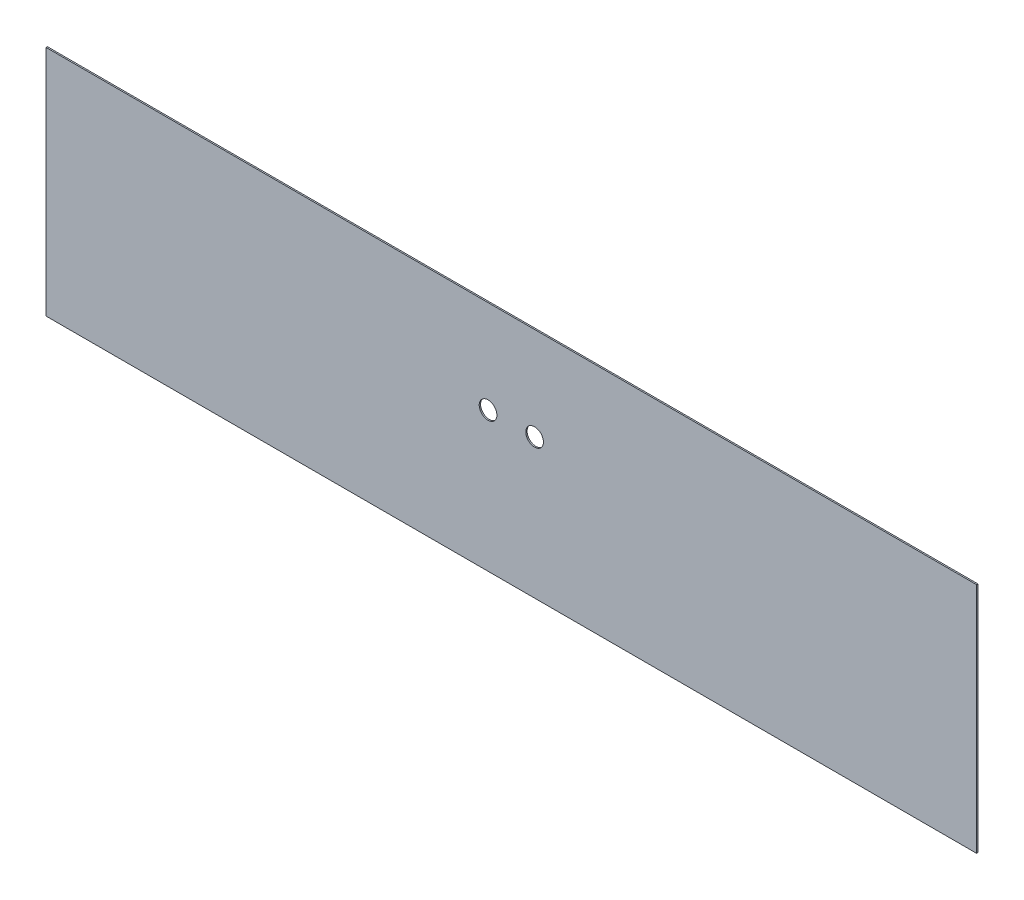
ISO-10303-21;
HEADER;
FILE_DESCRIPTION(('STEP AP214'),'2;1');
FILE_NAME('part.step','',(''),(''),'','','');
FILE_SCHEMA(('AUTOMOTIVE_DESIGN { 1 0 10303 214 1 1 1 1 }'));
ENDSEC;
DATA;
#1=APPLICATION_CONTEXT('core data for automotive mechanical design processes');
#2=APPLICATION_PROTOCOL_DEFINITION('international standard','automotive_design',2000,#1);
#3=PRODUCT_CONTEXT('',#1,'mechanical');
#4=PRODUCT('Part','Part','',(#3));
#5=PRODUCT_RELATED_PRODUCT_CATEGORY('part','',(#4));
#6=PRODUCT_DEFINITION_FORMATION('','',#4);
#7=PRODUCT_DEFINITION_CONTEXT('part definition',#1,'design');
#8=PRODUCT_DEFINITION('design','',#6,#7);
#9=PRODUCT_DEFINITION_SHAPE('','',#8);
#10=(LENGTH_UNIT() NAMED_UNIT(*) SI_UNIT(.MILLI.,.METRE.));
#11=(NAMED_UNIT(*) PLANE_ANGLE_UNIT() SI_UNIT($,.RADIAN.));
#12=(NAMED_UNIT(*) SI_UNIT($,.STERADIAN.) SOLID_ANGLE_UNIT());
#13=UNCERTAINTY_MEASURE_WITH_UNIT(LENGTH_MEASURE(1.E-05),#10,'distance_accuracy_value','');
#14=(GEOMETRIC_REPRESENTATION_CONTEXT(3) GLOBAL_UNCERTAINTY_ASSIGNED_CONTEXT((#13)) GLOBAL_UNIT_ASSIGNED_CONTEXT((#10,
#11,#12)) REPRESENTATION_CONTEXT('',''));
#15=CARTESIAN_POINT('',(0.,0.,0.));
#16=DIRECTION('',(0.,0.,1.));
#17=DIRECTION('',(1.,0.,0.));
#18=AXIS2_PLACEMENT_3D('',#15,#16,#17);
#19=CARTESIAN_POINT('',(0.,0.,-0.7366));
#20=DIRECTION('',(-1.,0.,0.));
#21=DIRECTION('',(0.,0.,1.));
#22=AXIS2_PLACEMENT_3D('',#19,#20,#21);
#23=PLANE('',#22);
#24=DIRECTION('',(0.,-1.,0.));
#25=VECTOR('',#24,1.);
#26=CARTESIAN_POINT('',(0.,0.,0.));
#27=LINE('',#26,#25);
#28=CARTESIAN_POINT('',(0.,127.,0.));
#29=VERTEX_POINT('',#28);
#30=CARTESIAN_POINT('',(0.,0.,0.));
#31=VERTEX_POINT('',#30);
#32=EDGE_CURVE('E99',#29,#31,#27,.T.);
#33=ORIENTED_EDGE('',*,*,#32,.F.);
#34=DIRECTION('',(0.,0.,1.));
#35=VECTOR('',#34,1.);
#36=CARTESIAN_POINT('',(0.,127.,-0.7366));
#37=LINE('',#36,#35);
#38=CARTESIAN_POINT('',(0.,127.,-0.7366));
#39=VERTEX_POINT('',#38);
#40=EDGE_CURVE('E11',#39,#29,#37,.T.);
#41=ORIENTED_EDGE('',*,*,#40,.F.);
#42=DIRECTION('',(0.,-1.,0.));
#43=VECTOR('',#42,1.);
#44=CARTESIAN_POINT('',(0.,0.,-0.7366));
#45=LINE('',#44,#43);
#46=CARTESIAN_POINT('',(0.,0.,-0.7366));
#47=VERTEX_POINT('',#46);
#48=EDGE_CURVE('E92',#39,#47,#45,.T.);
#49=ORIENTED_EDGE('',*,*,#48,.T.);
#50=DIRECTION('',(0.,0.,1.));
#51=VECTOR('',#50,1.);
#52=CARTESIAN_POINT('',(0.,0.,-0.7366));
#53=LINE('',#52,#51);
#54=EDGE_CURVE('E37',#47,#31,#53,.T.);
#55=ORIENTED_EDGE('',*,*,#54,.T.);
#56=EDGE_LOOP('',(#33,#41,#49,#55));
#57=FACE_BOUND('',#56,.T.);
#58=ADVANCED_FACE('F34',(#57),#23,.T.);
#59=CARTESIAN_POINT('',(0.,127.,-0.7366));
#60=DIRECTION('',(0.,1.,0.));
#61=DIRECTION('',(0.,0.,1.));
#62=AXIS2_PLACEMENT_3D('',#59,#60,#61);
#63=PLANE('',#62);
#64=DIRECTION('',(-1.,0.,0.));
#65=VECTOR('',#64,1.);
#66=CARTESIAN_POINT('',(0.,127.,0.));
#67=LINE('',#66,#65);
#68=CARTESIAN_POINT('',(508.,127.,0.));
#69=VERTEX_POINT('',#68);
#70=EDGE_CURVE('E94',#69,#29,#67,.T.);
#71=ORIENTED_EDGE('',*,*,#70,.F.);
#72=DIRECTION('',(0.,0.,1.));
#73=VECTOR('',#72,1.);
#74=CARTESIAN_POINT('',(508.,127.,-0.7366));
#75=LINE('',#74,#73);
#76=CARTESIAN_POINT('',(508.,127.,-0.7366));
#77=VERTEX_POINT('',#76);
#78=EDGE_CURVE('E43',#77,#69,#75,.T.);
#79=ORIENTED_EDGE('',*,*,#78,.F.);
#80=DIRECTION('',(-1.,0.,0.));
#81=VECTOR('',#80,1.);
#82=CARTESIAN_POINT('',(0.,127.,-0.7366));
#83=LINE('',#82,#81);
#84=EDGE_CURVE('E89',#77,#39,#83,.T.);
#85=ORIENTED_EDGE('',*,*,#84,.T.);
#86=ORIENTED_EDGE('',*,*,#40,.T.);
#87=EDGE_LOOP('',(#71,#79,#85,#86));
#88=FACE_BOUND('',#87,.T.);
#89=ADVANCED_FACE('F110',(#88),#63,.T.);
#90=CARTESIAN_POINT('',(508.,0.,-0.7366));
#91=DIRECTION('',(1.,0.,0.));
#92=DIRECTION('',(0.,0.,-1.));
#93=AXIS2_PLACEMENT_3D('',#90,#91,#92);
#94=PLANE('',#93);
#95=DIRECTION('',(0.,1.,0.));
#96=VECTOR('',#95,1.);
#97=CARTESIAN_POINT('',(508.,0.,0.));
#98=LINE('',#97,#96);
#99=CARTESIAN_POINT('',(508.,0.,0.));
#100=VERTEX_POINT('',#99);
#101=EDGE_CURVE('E84',#100,#69,#98,.T.);
#102=ORIENTED_EDGE('',*,*,#101,.F.);
#103=DIRECTION('',(0.,0.,1.));
#104=VECTOR('',#103,1.);
#105=CARTESIAN_POINT('',(508.,0.,-0.7366));
#106=LINE('',#105,#104);
#107=CARTESIAN_POINT('',(508.,0.,-0.7366));
#108=VERTEX_POINT('',#107);
#109=EDGE_CURVE('E79',#108,#100,#106,.T.);
#110=ORIENTED_EDGE('',*,*,#109,.F.);
#111=DIRECTION('',(0.,1.,0.));
#112=VECTOR('',#111,1.);
#113=CARTESIAN_POINT('',(508.,0.,-0.7366));
#114=LINE('',#113,#112);
#115=EDGE_CURVE('E82',#108,#77,#114,.T.);
#116=ORIENTED_EDGE('',*,*,#115,.T.);
#117=ORIENTED_EDGE('',*,*,#78,.T.);
#118=EDGE_LOOP('',(#102,#110,#116,#117));
#119=FACE_BOUND('',#118,.T.);
#120=ADVANCED_FACE('F81',(#119),#94,.T.);
#121=CARTESIAN_POINT('',(0.,0.,-0.7366));
#122=DIRECTION('',(0.,-1.,0.));
#123=DIRECTION('',(0.,0.,-1.));
#124=AXIS2_PLACEMENT_3D('',#121,#122,#123);
#125=PLANE('',#124);
#126=DIRECTION('',(1.,0.,0.));
#127=VECTOR('',#126,1.);
#128=CARTESIAN_POINT('',(0.,0.,0.));
#129=LINE('',#128,#127);
#130=EDGE_CURVE('E102',#31,#100,#129,.T.);
#131=ORIENTED_EDGE('',*,*,#130,.F.);
#132=ORIENTED_EDGE('',*,*,#54,.F.);
#133=DIRECTION('',(1.,0.,0.));
#134=VECTOR('',#133,1.);
#135=CARTESIAN_POINT('',(0.,0.,-0.7366));
#136=LINE('',#135,#134);
#137=EDGE_CURVE('E88',#47,#108,#136,.T.);
#138=ORIENTED_EDGE('',*,*,#137,.T.);
#139=ORIENTED_EDGE('',*,*,#109,.T.);
#140=EDGE_LOOP('',(#131,#132,#138,#139));
#141=FACE_BOUND('',#140,.T.);
#142=ADVANCED_FACE('F91',(#141),#125,.T.);
#143=CARTESIAN_POINT('',(0.,0.,-0.7366));
#144=DIRECTION('',(0.,0.,-1.));
#145=DIRECTION('',(-1.,0.,0.));
#146=AXIS2_PLACEMENT_3D('',#143,#144,#145);
#147=PLANE('',#146);
#148=CARTESIAN_POINT('',(266.7,76.2,-0.7366));
#149=DIRECTION('',(0.,0.,-1.));
#150=DIRECTION('',(-1.,0.,0.));
#151=AXIS2_PLACEMENT_3D('',#148,#149,#150);
#152=CIRCLE('',#151,4.82599999999999);
#153=CARTESIAN_POINT('',(261.874,76.2,-0.7366));
#154=VERTEX_POINT('',#153);
#155=EDGE_CURVE('E143',#154,#154,#152,.T.);
#156=ORIENTED_EDGE('',*,*,#155,.F.);
#157=EDGE_LOOP('',(#156));
#158=FACE_BOUND('',#157,.T.);
#159=CARTESIAN_POINT('',(241.3,76.2,-0.7366));
#160=DIRECTION('',(0.,0.,-1.));
#161=DIRECTION('',(-1.,0.,0.));
#162=AXIS2_PLACEMENT_3D('',#159,#160,#161);
#163=CIRCLE('',#162,4.82599999999999);
#164=CARTESIAN_POINT('',(236.474,76.2,-0.7366));
#165=VERTEX_POINT('',#164);
#166=EDGE_CURVE('E103',#165,#165,#163,.T.);
#167=ORIENTED_EDGE('',*,*,#166,.F.);
#168=EDGE_LOOP('',(#167));
#169=FACE_BOUND('',#168,.T.);
#170=ORIENTED_EDGE('',*,*,#48,.F.);
#171=ORIENTED_EDGE('',*,*,#84,.F.);
#172=ORIENTED_EDGE('',*,*,#115,.F.);
#173=ORIENTED_EDGE('',*,*,#137,.F.);
#174=EDGE_LOOP('',(#170,#171,#172,#173));
#175=FACE_BOUND('',#174,.T.);
#176=ADVANCED_FACE('F87',(#158,#169,#175),#147,.T.);
#177=CARTESIAN_POINT('',(0.,0.,0.));
#178=DIRECTION('',(0.,0.,-1.));
#179=DIRECTION('',(-1.,0.,0.));
#180=AXIS2_PLACEMENT_3D('',#177,#178,#179);
#181=PLANE('',#180);
#182=CARTESIAN_POINT('',(266.7,76.2,0.));
#183=DIRECTION('',(0.,0.,1.));
#184=DIRECTION('',(1.,0.,0.));
#185=AXIS2_PLACEMENT_3D('',#182,#183,#184);
#186=CIRCLE('',#185,4.82599999999999);
#187=CARTESIAN_POINT('',(271.526,76.2,0.));
#188=VERTEX_POINT('',#187);
#189=EDGE_CURVE('E146',#188,#188,#186,.T.);
#190=ORIENTED_EDGE('',*,*,#189,.F.);
#191=EDGE_LOOP('',(#190));
#192=FACE_BOUND('',#191,.T.);
#193=CARTESIAN_POINT('',(241.3,76.2,0.));
#194=DIRECTION('',(0.,0.,1.));
#195=DIRECTION('',(1.,0.,0.));
#196=AXIS2_PLACEMENT_3D('',#193,#194,#195);
#197=CIRCLE('',#196,4.82599999999999);
#198=CARTESIAN_POINT('',(246.126,76.2,0.));
#199=VERTEX_POINT('',#198);
#200=EDGE_CURVE('E148',#199,#199,#197,.T.);
#201=ORIENTED_EDGE('',*,*,#200,.F.);
#202=EDGE_LOOP('',(#201));
#203=FACE_BOUND('',#202,.T.);
#204=ORIENTED_EDGE('',*,*,#32,.T.);
#205=ORIENTED_EDGE('',*,*,#130,.T.);
#206=ORIENTED_EDGE('',*,*,#101,.T.);
#207=ORIENTED_EDGE('',*,*,#70,.T.);
#208=EDGE_LOOP('',(#204,#205,#206,#207));
#209=FACE_BOUND('',#208,.T.);
#210=ADVANCED_FACE('F109',(#192,#203,#209),#181,.F.);
#211=CARTESIAN_POINT('',(241.3,76.2,-2.54));
#212=DIRECTION('',(0.,0.,1.));
#213=DIRECTION('',(1.,0.,0.));
#214=AXIS2_PLACEMENT_3D('',#211,#212,#213);
#215=CYLINDRICAL_SURFACE('',#214,4.82599999999999);
#216=ORIENTED_EDGE('',*,*,#166,.T.);
#217=EDGE_LOOP('',(#216));
#218=FACE_BOUND('',#217,.T.);
#219=ORIENTED_EDGE('',*,*,#200,.T.);
#220=EDGE_LOOP('',(#219));
#221=FACE_BOUND('',#220,.T.);
#222=ADVANCED_FACE('F128',(#218,#221),#215,.F.);
#223=CARTESIAN_POINT('',(266.7,76.2,-2.54));
#224=DIRECTION('',(0.,0.,1.));
#225=DIRECTION('',(1.,0.,0.));
#226=AXIS2_PLACEMENT_3D('',#223,#224,#225);
#227=CYLINDRICAL_SURFACE('',#226,4.82599999999999);
#228=ORIENTED_EDGE('',*,*,#155,.T.);
#229=EDGE_LOOP('',(#228));
#230=FACE_BOUND('',#229,.T.);
#231=ORIENTED_EDGE('',*,*,#189,.T.);
#232=EDGE_LOOP('',(#231));
#233=FACE_BOUND('',#232,.T.);
#234=ADVANCED_FACE('F135',(#230,#233),#227,.F.);
#235=CLOSED_SHELL('',(#58,#89,#120,#142,#176,#210,#222,#234));
#236=MANIFOLD_SOLID_BREP('B2',#235);
#237=ADVANCED_BREP_SHAPE_REPRESENTATION('',(#18,#236),#14);
#238=SHAPE_DEFINITION_REPRESENTATION(#9,#237);
ENDSEC;
END-ISO-10303-21;
